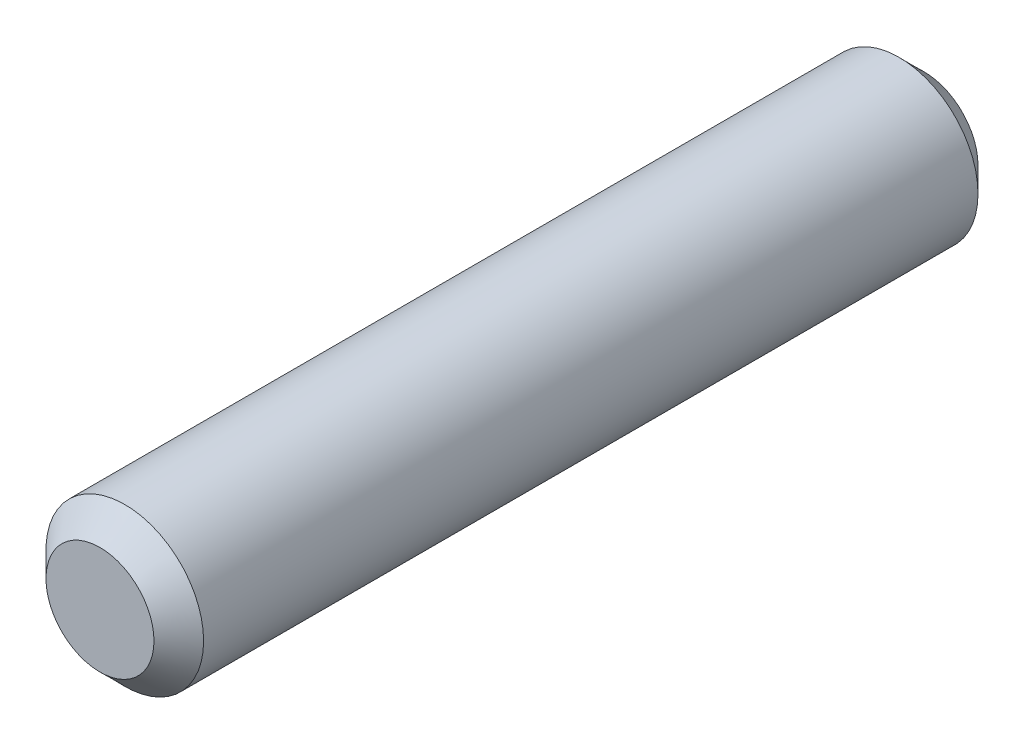
ISO-10303-21;
HEADER;
FILE_DESCRIPTION(('STEP AP214'),'2;1');
FILE_NAME('part.step','',(''),(''),'','','');
FILE_SCHEMA(('AUTOMOTIVE_DESIGN { 1 0 10303 214 1 1 1 1 }'));
ENDSEC;
DATA;
#1=APPLICATION_CONTEXT('core data for automotive mechanical design processes');
#2=APPLICATION_PROTOCOL_DEFINITION('international standard','automotive_design',2000,#1);
#3=PRODUCT_CONTEXT('',#1,'mechanical');
#4=PRODUCT('Part','Part','',(#3));
#5=PRODUCT_RELATED_PRODUCT_CATEGORY('part','',(#4));
#6=PRODUCT_DEFINITION_FORMATION('','',#4);
#7=PRODUCT_DEFINITION_CONTEXT('part definition',#1,'design');
#8=PRODUCT_DEFINITION('design','',#6,#7);
#9=PRODUCT_DEFINITION_SHAPE('','',#8);
#10=(LENGTH_UNIT() NAMED_UNIT(*) SI_UNIT(.MILLI.,.METRE.));
#11=(NAMED_UNIT(*) PLANE_ANGLE_UNIT() SI_UNIT($,.RADIAN.));
#12=(NAMED_UNIT(*) SI_UNIT($,.STERADIAN.) SOLID_ANGLE_UNIT());
#13=UNCERTAINTY_MEASURE_WITH_UNIT(LENGTH_MEASURE(1.E-05),#10,'distance_accuracy_value','');
#14=(GEOMETRIC_REPRESENTATION_CONTEXT(3) GLOBAL_UNCERTAINTY_ASSIGNED_CONTEXT((#13)) GLOBAL_UNIT_ASSIGNED_CONTEXT((#10,
#11,#12)) REPRESENTATION_CONTEXT('',''));
#15=CARTESIAN_POINT('',(0.,0.,0.));
#16=DIRECTION('',(0.,0.,1.));
#17=DIRECTION('',(1.,0.,0.));
#18=AXIS2_PLACEMENT_3D('',#15,#16,#17);
#19=CARTESIAN_POINT('',(0.,0.,33.2));
#20=DIRECTION('',(0.,0.,-1.));
#21=DIRECTION('',(-1.,0.,0.));
#22=AXIS2_PLACEMENT_3D('',#19,#20,#21);
#23=CYLINDRICAL_SURFACE('',#22,3.175);
#24=CARTESIAN_POINT('',(0.,0.,32.2));
#25=DIRECTION('',(0.,0.,1.));
#26=DIRECTION('',(1.,0.,0.));
#27=AXIS2_PLACEMENT_3D('',#24,#25,#26);
#28=CIRCLE('',#27,3.175);
#29=CARTESIAN_POINT('',(3.175,0.,32.2));
#30=VERTEX_POINT('',#29);
#31=EDGE_CURVE('E54',#30,#30,#28,.F.);
#32=ORIENTED_EDGE('',*,*,#31,.T.);
#33=EDGE_LOOP('',(#32));
#34=FACE_BOUND('',#33,.T.);
#35=CARTESIAN_POINT('',(0.,0.,1.00000000000001));
#36=DIRECTION('',(0.,0.,1.));
#37=DIRECTION('',(1.,0.,0.));
#38=AXIS2_PLACEMENT_3D('',#35,#36,#37);
#39=CIRCLE('',#38,3.175);
#40=CARTESIAN_POINT('',(3.175,0.,1.00000000000001));
#41=VERTEX_POINT('',#40);
#42=EDGE_CURVE('E59',#41,#41,#39,.T.);
#43=ORIENTED_EDGE('',*,*,#42,.T.);
#44=EDGE_LOOP('',(#43));
#45=FACE_BOUND('',#44,.T.);
#46=ADVANCED_FACE('F45',(#34,#45),#23,.T.);
#47=CARTESIAN_POINT('',(0.,0.,33.2));
#48=DIRECTION('',(0.,0.,1.));
#49=DIRECTION('',(1.,0.,0.));
#50=AXIS2_PLACEMENT_3D('',#47,#48,#49);
#51=PLANE('',#50);
#52=CARTESIAN_POINT('',(0.,0.,33.2));
#53=DIRECTION('',(0.,0.,1.));
#54=DIRECTION('',(1.,0.,0.));
#55=AXIS2_PLACEMENT_3D('',#52,#53,#54);
#56=CIRCLE('',#55,2.17500000000002);
#57=CARTESIAN_POINT('',(2.17500000000002,0.,33.2));
#58=VERTEX_POINT('',#57);
#59=EDGE_CURVE('E64',#58,#58,#56,.T.);
#60=ORIENTED_EDGE('',*,*,#59,.T.);
#61=EDGE_LOOP('',(#60));
#62=FACE_BOUND('',#61,.T.);
#63=ADVANCED_FACE('F71',(#62),#51,.T.);
#64=CARTESIAN_POINT('',(0.,0.,0.));
#65=DIRECTION('',(0.,0.,1.));
#66=DIRECTION('',(1.,0.,0.));
#67=AXIS2_PLACEMENT_3D('',#64,#65,#66);
#68=PLANE('',#67);
#69=CARTESIAN_POINT('',(0.,0.,0.));
#70=DIRECTION('',(0.,0.,1.));
#71=DIRECTION('',(1.,0.,0.));
#72=AXIS2_PLACEMENT_3D('',#69,#70,#71);
#73=CIRCLE('',#72,2.17499999999999);
#74=CARTESIAN_POINT('',(2.17499999999999,0.,0.));
#75=VERTEX_POINT('',#74);
#76=EDGE_CURVE('E10',#75,#75,#73,.F.);
#77=ORIENTED_EDGE('',*,*,#76,.T.);
#78=EDGE_LOOP('',(#77));
#79=FACE_BOUND('',#78,.T.);
#80=ADVANCED_FACE('F75',(#79),#68,.F.);
#81=CARTESIAN_POINT('',(0.,0.,33.2));
#82=DIRECTION('',(0.,0.,-1.));
#83=DIRECTION('',(-1.,0.,0.));
#84=AXIS2_PLACEMENT_3D('',#81,#82,#83);
#85=CONICAL_SURFACE('',#84,2.17500000000002,0.78539816339745);
#86=ORIENTED_EDGE('',*,*,#31,.F.);
#87=EDGE_LOOP('',(#86));
#88=FACE_BOUND('',#87,.T.);
#89=ORIENTED_EDGE('',*,*,#59,.F.);
#90=EDGE_LOOP('',(#89));
#91=FACE_BOUND('',#90,.T.);
#92=ADVANCED_FACE('F73',(#88,#91),#85,.T.);
#93=CARTESIAN_POINT('',(0.,0.,1.00000000000001));
#94=DIRECTION('',(0.,0.,1.));
#95=DIRECTION('',(1.,0.,0.));
#96=AXIS2_PLACEMENT_3D('',#93,#94,#95);
#97=CONICAL_SURFACE('',#96,3.175,0.785398163397452);
#98=ORIENTED_EDGE('',*,*,#76,.F.);
#99=EDGE_LOOP('',(#98));
#100=FACE_BOUND('',#99,.T.);
#101=ORIENTED_EDGE('',*,*,#42,.F.);
#102=EDGE_LOOP('',(#101));
#103=FACE_BOUND('',#102,.T.);
#104=ADVANCED_FACE('F48',(#100,#103),#97,.T.);
#105=CLOSED_SHELL('',(#46,#63,#80,#92,#104));
#106=MANIFOLD_SOLID_BREP('B2',#105);
#107=ADVANCED_BREP_SHAPE_REPRESENTATION('',(#18,#106),#14);
#108=SHAPE_DEFINITION_REPRESENTATION(#9,#107);
ENDSEC;
END-ISO-10303-21;
